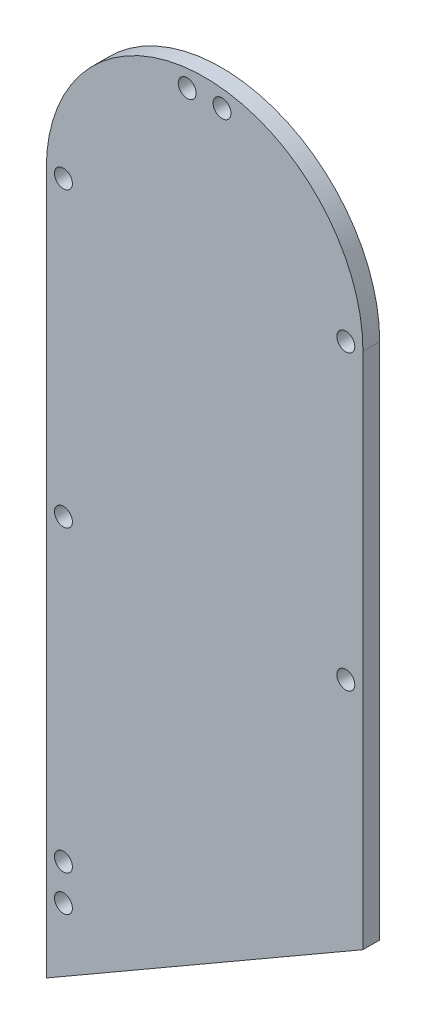
ISO-10303-21;
HEADER;
FILE_DESCRIPTION(('STEP AP214'),'2;1');
FILE_NAME('part.step','',(''),(''),'','','');
FILE_SCHEMA(('AUTOMOTIVE_DESIGN { 1 0 10303 214 1 1 1 1 }'));
ENDSEC;
DATA;
#1=APPLICATION_CONTEXT('core data for automotive mechanical design processes');
#2=APPLICATION_PROTOCOL_DEFINITION('international standard','automotive_design',2000,#1);
#3=PRODUCT_CONTEXT('',#1,'mechanical');
#4=PRODUCT('Part','Part','',(#3));
#5=PRODUCT_RELATED_PRODUCT_CATEGORY('part','',(#4));
#6=PRODUCT_DEFINITION_FORMATION('','',#4);
#7=PRODUCT_DEFINITION_CONTEXT('part definition',#1,'design');
#8=PRODUCT_DEFINITION('design','',#6,#7);
#9=PRODUCT_DEFINITION_SHAPE('','',#8);
#10=(LENGTH_UNIT() NAMED_UNIT(*) SI_UNIT(.MILLI.,.METRE.));
#11=(NAMED_UNIT(*) PLANE_ANGLE_UNIT() SI_UNIT($,.RADIAN.));
#12=(NAMED_UNIT(*) SI_UNIT($,.STERADIAN.) SOLID_ANGLE_UNIT());
#13=UNCERTAINTY_MEASURE_WITH_UNIT(LENGTH_MEASURE(1.E-05),#10,'distance_accuracy_value','');
#14=(GEOMETRIC_REPRESENTATION_CONTEXT(3) GLOBAL_UNCERTAINTY_ASSIGNED_CONTEXT((#13)) GLOBAL_UNIT_ASSIGNED_CONTEXT((#10,
#11,#12)) REPRESENTATION_CONTEXT('',''));
#15=CARTESIAN_POINT('',(0.,0.,0.));
#16=DIRECTION('',(0.,0.,1.));
#17=DIRECTION('',(1.,0.,0.));
#18=AXIS2_PLACEMENT_3D('',#15,#16,#17);
#19=CARTESIAN_POINT('',(24.5827179372451,-59.5829059297929,3.175));
#20=DIRECTION('',(0.,0.,1.));
#21=DIRECTION('',(1.,0.,0.));
#22=AXIS2_PLACEMENT_3D('',#19,#20,#21);
#23=PLANE('',#22);
#24=DIRECTION('',(-0.866025403784438,-0.500000000000001,0.));
#25=VECTOR('',#24,1.);
#26=CARTESIAN_POINT('',(-23.1785985762499,28.3308495887852,3.175));
#27=LINE('',#26,#25);
#28=CARTESIAN_POINT('',(54.5827179372451,73.2263666103914,3.175));
#29=VERTEX_POINT('',#28);
#30=CARTESIAN_POINT('',(-5.41728206275491,38.5853504590137,3.175));
#31=VERTEX_POINT('',#30);
#32=EDGE_CURVE('E48',#29,#31,#27,.T.);
#33=ORIENTED_EDGE('',*,*,#32,.F.);
#34=DIRECTION('',(0.,1.,0.));
#35=VECTOR('',#34,1.);
#36=CARTESIAN_POINT('',(54.5827179372451,-59.5829059297929,3.175));
#37=LINE('',#36,#35);
#38=CARTESIAN_POINT('',(54.5827179372451,171.394622999198,3.175));
#39=VERTEX_POINT('',#38);
#40=EDGE_CURVE('E91',#29,#39,#37,.T.);
#41=ORIENTED_EDGE('',*,*,#40,.T.);
#42=CARTESIAN_POINT('',(24.5827179372451,171.394622999198,3.175));
#43=DIRECTION('',(0.,0.,1.));
#44=DIRECTION('',(1.,0.,0.));
#45=AXIS2_PLACEMENT_3D('',#42,#43,#44);
#46=CIRCLE('',#45,30.);
#47=CARTESIAN_POINT('',(-5.41728206275491,171.394622999198,3.175));
#48=VERTEX_POINT('',#47);
#49=EDGE_CURVE('E56',#39,#48,#46,.T.);
#50=ORIENTED_EDGE('',*,*,#49,.T.);
#51=DIRECTION('',(0.,-1.,0.));
#52=VECTOR('',#51,1.);
#53=CARTESIAN_POINT('',(-5.41728206275491,171.394622999198,3.175));
#54=LINE('',#53,#52);
#55=EDGE_CURVE('E84',#48,#31,#54,.T.);
#56=ORIENTED_EDGE('',*,*,#55,.T.);
#57=EDGE_LOOP('',(#33,#41,#50,#56));
#58=FACE_BOUND('',#57,.T.);
#59=CARTESIAN_POINT('',(21.2827179372451,197.940291195723,3.175));
#60=DIRECTION('',(0.,0.,1.));
#61=DIRECTION('',(1.,0.,0.));
#62=AXIS2_PLACEMENT_3D('',#59,#60,#61);
#63=CIRCLE('',#62,1.70000000000001);
#64=CARTESIAN_POINT('',(22.9827179372451,197.940291195723,3.175));
#65=VERTEX_POINT('',#64);
#66=EDGE_CURVE('E132',#65,#65,#63,.T.);
#67=ORIENTED_EDGE('',*,*,#66,.F.);
#68=EDGE_LOOP('',(#67));
#69=FACE_BOUND('',#68,.T.);
#70=CARTESIAN_POINT('',(51.3327179372449,115.905858534703,3.175));
#71=DIRECTION('',(0.,0.,1.));
#72=DIRECTION('',(1.,0.,0.));
#73=AXIS2_PLACEMENT_3D('',#70,#71,#72);
#74=CIRCLE('',#73,1.70000000000001);
#75=CARTESIAN_POINT('',(53.0327179372449,115.905858534703,3.175));
#76=VERTEX_POINT('',#75);
#77=EDGE_CURVE('E120',#76,#76,#74,.T.);
#78=ORIENTED_EDGE('',*,*,#77,.F.);
#79=EDGE_LOOP('',(#78));
#80=FACE_BOUND('',#79,.T.);
#81=CARTESIAN_POINT('',(51.3327179372474,171.3946229992,3.175));
#82=DIRECTION('',(0.,0.,1.));
#83=DIRECTION('',(1.,0.,0.));
#84=AXIS2_PLACEMENT_3D('',#81,#82,#83);
#85=CIRCLE('',#84,1.70000000000001);
#86=CARTESIAN_POINT('',(53.0327179372474,171.3946229992,3.175));
#87=VERTEX_POINT('',#86);
#88=EDGE_CURVE('E102',#87,#87,#85,.T.);
#89=ORIENTED_EDGE('',*,*,#88,.F.);
#90=EDGE_LOOP('',(#89));
#91=FACE_BOUND('',#90,.T.);
#92=CARTESIAN_POINT('',(27.8827179372451,197.940291195723,3.175));
#93=DIRECTION('',(0.,0.,1.));
#94=DIRECTION('',(1.,0.,0.));
#95=AXIS2_PLACEMENT_3D('',#92,#93,#94);
#96=CIRCLE('',#95,1.70000000000001);
#97=CARTESIAN_POINT('',(29.5827179372451,197.940291195723,3.175));
#98=VERTEX_POINT('',#97);
#99=EDGE_CURVE('E96',#98,#98,#96,.T.);
#100=ORIENTED_EDGE('',*,*,#99,.F.);
#101=EDGE_LOOP('',(#100));
#102=FACE_BOUND('',#101,.T.);
#103=CARTESIAN_POINT('',(-2.1672820627549,59.3058585347025,3.175));
#104=DIRECTION('',(0.,0.,1.));
#105=DIRECTION('',(1.,0.,0.));
#106=AXIS2_PLACEMENT_3D('',#103,#104,#105);
#107=CIRCLE('',#106,1.70000000000001);
#108=CARTESIAN_POINT('',(-0.46728206275489,59.3058585347025,3.175));
#109=VERTEX_POINT('',#108);
#110=EDGE_CURVE('E108',#109,#109,#107,.T.);
#111=ORIENTED_EDGE('',*,*,#110,.F.);
#112=EDGE_LOOP('',(#111));
#113=FACE_BOUND('',#112,.T.);
#114=CARTESIAN_POINT('',(-2.16728206275266,171.394622999196,3.175));
#115=DIRECTION('',(0.,0.,1.));
#116=DIRECTION('',(1.,0.,0.));
#117=AXIS2_PLACEMENT_3D('',#114,#115,#116);
#118=CIRCLE('',#117,1.70000000000001);
#119=CARTESIAN_POINT('',(-0.467282062752642,171.394622999196,3.175));
#120=VERTEX_POINT('',#119);
#121=EDGE_CURVE('E114',#120,#120,#118,.T.);
#122=ORIENTED_EDGE('',*,*,#121,.F.);
#123=EDGE_LOOP('',(#122));
#124=FACE_BOUND('',#123,.T.);
#125=CARTESIAN_POINT('',(-2.16728206275513,115.905858534703,3.175));
#126=DIRECTION('',(0.,0.,1.));
#127=DIRECTION('',(1.,0.,0.));
#128=AXIS2_PLACEMENT_3D('',#125,#126,#127);
#129=CIRCLE('',#128,1.70000000000001);
#130=CARTESIAN_POINT('',(-0.467282062755112,115.905858534703,3.175));
#131=VERTEX_POINT('',#130);
#132=EDGE_CURVE('E126',#131,#131,#129,.T.);
#133=ORIENTED_EDGE('',*,*,#132,.F.);
#134=EDGE_LOOP('',(#133));
#135=FACE_BOUND('',#134,.T.);
#136=CARTESIAN_POINT('',(-2.1672820627549,52.5058585347025,3.175));
#137=DIRECTION('',(0.,0.,1.));
#138=DIRECTION('',(1.,0.,0.));
#139=AXIS2_PLACEMENT_3D('',#136,#137,#138);
#140=CIRCLE('',#139,1.70000000000001);
#141=CARTESIAN_POINT('',(-0.46728206275489,52.5058585347025,3.175));
#142=VERTEX_POINT('',#141);
#143=EDGE_CURVE('E138',#142,#142,#140,.T.);
#144=ORIENTED_EDGE('',*,*,#143,.F.);
#145=EDGE_LOOP('',(#144));
#146=FACE_BOUND('',#145,.T.);
#147=ADVANCED_FACE('F33',(#58,#69,#80,#91,#102,#113,#124,#135,#146),#23,.T.);
#148=CARTESIAN_POINT('',(24.5827179372451,-59.5829059297929,0.));
#149=DIRECTION('',(0.,0.,1.));
#150=DIRECTION('',(1.,0.,0.));
#151=AXIS2_PLACEMENT_3D('',#148,#149,#150);
#152=PLANE('',#151);
#153=DIRECTION('',(0.,1.,0.));
#154=VECTOR('',#153,1.);
#155=CARTESIAN_POINT('',(54.5827179372451,-59.5829059297929,0.));
#156=LINE('',#155,#154);
#157=CARTESIAN_POINT('',(54.5827179372451,73.2263666103914,0.));
#158=VERTEX_POINT('',#157);
#159=CARTESIAN_POINT('',(54.5827179372451,171.394622999198,0.));
#160=VERTEX_POINT('',#159);
#161=EDGE_CURVE('E79',#158,#160,#156,.T.);
#162=ORIENTED_EDGE('',*,*,#161,.F.);
#163=DIRECTION('',(-0.866025403784438,-0.500000000000001,0.));
#164=VECTOR('',#163,1.);
#165=CARTESIAN_POINT('',(-23.1785985762499,28.3308495887852,0.));
#166=LINE('',#165,#164);
#167=CARTESIAN_POINT('',(-5.41728206275491,38.5853504590137,0.));
#168=VERTEX_POINT('',#167);
#169=EDGE_CURVE('E90',#158,#168,#166,.T.);
#170=ORIENTED_EDGE('',*,*,#169,.T.);
#171=DIRECTION('',(0.,-1.,0.));
#172=VECTOR('',#171,1.);
#173=CARTESIAN_POINT('',(-5.41728206275491,171.394622999198,0.));
#174=LINE('',#173,#172);
#175=CARTESIAN_POINT('',(-5.41728206275491,171.394622999198,0.));
#176=VERTEX_POINT('',#175);
#177=EDGE_CURVE('E78',#176,#168,#174,.T.);
#178=ORIENTED_EDGE('',*,*,#177,.F.);
#179=CARTESIAN_POINT('',(24.5827179372451,171.394622999198,0.));
#180=DIRECTION('',(0.,0.,1.));
#181=DIRECTION('',(1.,0.,0.));
#182=AXIS2_PLACEMENT_3D('',#179,#180,#181);
#183=CIRCLE('',#182,30.);
#184=EDGE_CURVE('E69',#160,#176,#183,.T.);
#185=ORIENTED_EDGE('',*,*,#184,.F.);
#186=EDGE_LOOP('',(#162,#170,#178,#185));
#187=FACE_BOUND('',#186,.T.);
#188=CARTESIAN_POINT('',(27.8827179372451,197.940291195723,0.));
#189=DIRECTION('',(0.,0.,1.));
#190=DIRECTION('',(1.,0.,0.));
#191=AXIS2_PLACEMENT_3D('',#188,#189,#190);
#192=CIRCLE('',#191,1.70000000000001);
#193=CARTESIAN_POINT('',(29.5827179372451,197.940291195723,0.));
#194=VERTEX_POINT('',#193);
#195=EDGE_CURVE('E99',#194,#194,#192,.T.);
#196=ORIENTED_EDGE('',*,*,#195,.T.);
#197=EDGE_LOOP('',(#196));
#198=FACE_BOUND('',#197,.T.);
#199=CARTESIAN_POINT('',(51.3327179372474,171.3946229992,0.));
#200=DIRECTION('',(0.,0.,1.));
#201=DIRECTION('',(1.,0.,0.));
#202=AXIS2_PLACEMENT_3D('',#199,#200,#201);
#203=CIRCLE('',#202,1.70000000000001);
#204=CARTESIAN_POINT('',(53.0327179372474,171.3946229992,0.));
#205=VERTEX_POINT('',#204);
#206=EDGE_CURVE('E105',#205,#205,#203,.T.);
#207=ORIENTED_EDGE('',*,*,#206,.T.);
#208=EDGE_LOOP('',(#207));
#209=FACE_BOUND('',#208,.T.);
#210=CARTESIAN_POINT('',(-2.1672820627549,59.3058585347025,0.));
#211=DIRECTION('',(0.,0.,1.));
#212=DIRECTION('',(1.,0.,0.));
#213=AXIS2_PLACEMENT_3D('',#210,#211,#212);
#214=CIRCLE('',#213,1.70000000000001);
#215=CARTESIAN_POINT('',(-0.46728206275489,59.3058585347025,0.));
#216=VERTEX_POINT('',#215);
#217=EDGE_CURVE('E111',#216,#216,#214,.T.);
#218=ORIENTED_EDGE('',*,*,#217,.T.);
#219=EDGE_LOOP('',(#218));
#220=FACE_BOUND('',#219,.T.);
#221=CARTESIAN_POINT('',(-2.16728206275266,171.394622999196,0.));
#222=DIRECTION('',(0.,0.,1.));
#223=DIRECTION('',(1.,0.,0.));
#224=AXIS2_PLACEMENT_3D('',#221,#222,#223);
#225=CIRCLE('',#224,1.70000000000001);
#226=CARTESIAN_POINT('',(-0.467282062752642,171.394622999196,0.));
#227=VERTEX_POINT('',#226);
#228=EDGE_CURVE('E117',#227,#227,#225,.T.);
#229=ORIENTED_EDGE('',*,*,#228,.T.);
#230=EDGE_LOOP('',(#229));
#231=FACE_BOUND('',#230,.T.);
#232=CARTESIAN_POINT('',(51.3327179372449,115.905858534703,0.));
#233=DIRECTION('',(0.,0.,1.));
#234=DIRECTION('',(1.,0.,0.));
#235=AXIS2_PLACEMENT_3D('',#232,#233,#234);
#236=CIRCLE('',#235,1.70000000000001);
#237=CARTESIAN_POINT('',(53.0327179372449,115.905858534703,0.));
#238=VERTEX_POINT('',#237);
#239=EDGE_CURVE('E123',#238,#238,#236,.T.);
#240=ORIENTED_EDGE('',*,*,#239,.T.);
#241=EDGE_LOOP('',(#240));
#242=FACE_BOUND('',#241,.T.);
#243=CARTESIAN_POINT('',(-2.16728206275513,115.905858534703,0.));
#244=DIRECTION('',(0.,0.,1.));
#245=DIRECTION('',(1.,0.,0.));
#246=AXIS2_PLACEMENT_3D('',#243,#244,#245);
#247=CIRCLE('',#246,1.70000000000001);
#248=CARTESIAN_POINT('',(-0.467282062755112,115.905858534703,0.));
#249=VERTEX_POINT('',#248);
#250=EDGE_CURVE('E129',#249,#249,#247,.T.);
#251=ORIENTED_EDGE('',*,*,#250,.T.);
#252=EDGE_LOOP('',(#251));
#253=FACE_BOUND('',#252,.T.);
#254=CARTESIAN_POINT('',(21.2827179372451,197.940291195723,0.));
#255=DIRECTION('',(0.,0.,1.));
#256=DIRECTION('',(1.,0.,0.));
#257=AXIS2_PLACEMENT_3D('',#254,#255,#256);
#258=CIRCLE('',#257,1.70000000000001);
#259=CARTESIAN_POINT('',(22.9827179372451,197.940291195723,0.));
#260=VERTEX_POINT('',#259);
#261=EDGE_CURVE('E135',#260,#260,#258,.T.);
#262=ORIENTED_EDGE('',*,*,#261,.T.);
#263=EDGE_LOOP('',(#262));
#264=FACE_BOUND('',#263,.T.);
#265=CARTESIAN_POINT('',(-2.1672820627549,52.5058585347025,0.));
#266=DIRECTION('',(0.,0.,1.));
#267=DIRECTION('',(1.,0.,0.));
#268=AXIS2_PLACEMENT_3D('',#265,#266,#267);
#269=CIRCLE('',#268,1.70000000000001);
#270=CARTESIAN_POINT('',(-0.46728206275489,52.5058585347025,0.));
#271=VERTEX_POINT('',#270);
#272=EDGE_CURVE('E141',#271,#271,#269,.T.);
#273=ORIENTED_EDGE('',*,*,#272,.T.);
#274=EDGE_LOOP('',(#273));
#275=FACE_BOUND('',#274,.T.);
#276=ADVANCED_FACE('F87',(#187,#198,#209,#220,#231,#242,#253,#264,#275),#152,.F.);
#277=CARTESIAN_POINT('',(54.5827179372451,-59.5829059297929,3.175));
#278=DIRECTION('',(-1.,0.,0.));
#279=DIRECTION('',(0.,0.,1.));
#280=AXIS2_PLACEMENT_3D('',#277,#278,#279);
#281=PLANE('',#280);
#282=ORIENTED_EDGE('',*,*,#40,.F.);
#283=DIRECTION('',(0.,0.,-1.));
#284=VECTOR('',#283,1.);
#285=CARTESIAN_POINT('',(54.5827179372451,73.2263666103914,3.175));
#286=LINE('',#285,#284);
#287=EDGE_CURVE('E144',#29,#158,#286,.T.);
#288=ORIENTED_EDGE('',*,*,#287,.T.);
#289=ORIENTED_EDGE('',*,*,#161,.T.);
#290=DIRECTION('',(0.,0.,-1.));
#291=VECTOR('',#290,1.);
#292=CARTESIAN_POINT('',(54.5827179372451,171.394622999198,3.175));
#293=LINE('',#292,#291);
#294=EDGE_CURVE('E41',#39,#160,#293,.T.);
#295=ORIENTED_EDGE('',*,*,#294,.F.);
#296=EDGE_LOOP('',(#282,#288,#289,#295));
#297=FACE_BOUND('',#296,.T.);
#298=ADVANCED_FACE('F35',(#297),#281,.F.);
#299=CARTESIAN_POINT('',(24.5827179372451,171.394622999198,3.175));
#300=DIRECTION('',(0.,0.,-1.));
#301=DIRECTION('',(-1.,0.,0.));
#302=AXIS2_PLACEMENT_3D('',#299,#300,#301);
#303=CYLINDRICAL_SURFACE('',#302,30.);
#304=ORIENTED_EDGE('',*,*,#184,.T.);
#305=DIRECTION('',(0.,0.,-1.));
#306=VECTOR('',#305,1.);
#307=CARTESIAN_POINT('',(-5.41728206275491,171.394622999198,3.175));
#308=LINE('',#307,#306);
#309=EDGE_CURVE('E72',#48,#176,#308,.T.);
#310=ORIENTED_EDGE('',*,*,#309,.F.);
#311=ORIENTED_EDGE('',*,*,#49,.F.);
#312=ORIENTED_EDGE('',*,*,#294,.T.);
#313=EDGE_LOOP('',(#304,#310,#311,#312));
#314=FACE_BOUND('',#313,.T.);
#315=ADVANCED_FACE('F71',(#314),#303,.T.);
#316=CARTESIAN_POINT('',(-5.41728206275491,171.394622999198,3.175));
#317=DIRECTION('',(1.,0.,0.));
#318=DIRECTION('',(0.,0.,-1.));
#319=AXIS2_PLACEMENT_3D('',#316,#317,#318);
#320=PLANE('',#319);
#321=ORIENTED_EDGE('',*,*,#177,.T.);
#322=DIRECTION('',(0.,0.,1.));
#323=VECTOR('',#322,1.);
#324=CARTESIAN_POINT('',(-5.41728206275491,38.5853504590137,3.175));
#325=LINE('',#324,#323);
#326=EDGE_CURVE('E11',#168,#31,#325,.T.);
#327=ORIENTED_EDGE('',*,*,#326,.T.);
#328=ORIENTED_EDGE('',*,*,#55,.F.);
#329=ORIENTED_EDGE('',*,*,#309,.T.);
#330=EDGE_LOOP('',(#321,#327,#328,#329));
#331=FACE_BOUND('',#330,.T.);
#332=ADVANCED_FACE('F83',(#331),#320,.F.);
#333=CARTESIAN_POINT('',(27.8827179372451,197.940291195723,3.175));
#334=DIRECTION('',(0.,0.,-1.));
#335=DIRECTION('',(-1.,0.,0.));
#336=AXIS2_PLACEMENT_3D('',#333,#334,#335);
#337=CYLINDRICAL_SURFACE('',#336,1.70000000000001);
#338=ORIENTED_EDGE('',*,*,#99,.T.);
#339=EDGE_LOOP('',(#338));
#340=FACE_BOUND('',#339,.T.);
#341=ORIENTED_EDGE('',*,*,#195,.F.);
#342=EDGE_LOOP('',(#341));
#343=FACE_BOUND('',#342,.T.);
#344=ADVANCED_FACE('F191',(#340,#343),#337,.F.);
#345=CARTESIAN_POINT('',(51.3327179372474,171.3946229992,3.175));
#346=DIRECTION('',(0.,0.,-1.));
#347=DIRECTION('',(-1.,0.,0.));
#348=AXIS2_PLACEMENT_3D('',#345,#346,#347);
#349=CYLINDRICAL_SURFACE('',#348,1.70000000000001);
#350=ORIENTED_EDGE('',*,*,#88,.T.);
#351=EDGE_LOOP('',(#350));
#352=FACE_BOUND('',#351,.T.);
#353=ORIENTED_EDGE('',*,*,#206,.F.);
#354=EDGE_LOOP('',(#353));
#355=FACE_BOUND('',#354,.T.);
#356=ADVANCED_FACE('F208',(#352,#355),#349,.F.);
#357=CARTESIAN_POINT('',(-2.1672820627549,59.3058585347025,3.175));
#358=DIRECTION('',(0.,0.,-1.));
#359=DIRECTION('',(-1.,0.,0.));
#360=AXIS2_PLACEMENT_3D('',#357,#358,#359);
#361=CYLINDRICAL_SURFACE('',#360,1.70000000000001);
#362=ORIENTED_EDGE('',*,*,#110,.T.);
#363=EDGE_LOOP('',(#362));
#364=FACE_BOUND('',#363,.T.);
#365=ORIENTED_EDGE('',*,*,#217,.F.);
#366=EDGE_LOOP('',(#365));
#367=FACE_BOUND('',#366,.T.);
#368=ADVANCED_FACE('F215',(#364,#367),#361,.F.);
#369=CARTESIAN_POINT('',(-2.16728206275266,171.394622999196,3.175));
#370=DIRECTION('',(0.,0.,-1.));
#371=DIRECTION('',(-1.,0.,0.));
#372=AXIS2_PLACEMENT_3D('',#369,#370,#371);
#373=CYLINDRICAL_SURFACE('',#372,1.70000000000001);
#374=ORIENTED_EDGE('',*,*,#121,.T.);
#375=EDGE_LOOP('',(#374));
#376=FACE_BOUND('',#375,.T.);
#377=ORIENTED_EDGE('',*,*,#228,.F.);
#378=EDGE_LOOP('',(#377));
#379=FACE_BOUND('',#378,.T.);
#380=ADVANCED_FACE('F223',(#376,#379),#373,.F.);
#381=CARTESIAN_POINT('',(51.3327179372449,115.905858534703,3.175));
#382=DIRECTION('',(0.,0.,-1.));
#383=DIRECTION('',(-1.,0.,0.));
#384=AXIS2_PLACEMENT_3D('',#381,#382,#383);
#385=CYLINDRICAL_SURFACE('',#384,1.70000000000001);
#386=ORIENTED_EDGE('',*,*,#77,.T.);
#387=EDGE_LOOP('',(#386));
#388=FACE_BOUND('',#387,.T.);
#389=ORIENTED_EDGE('',*,*,#239,.F.);
#390=EDGE_LOOP('',(#389));
#391=FACE_BOUND('',#390,.T.);
#392=ADVANCED_FACE('F231',(#388,#391),#385,.F.);
#393=CARTESIAN_POINT('',(-2.16728206275513,115.905858534703,3.175));
#394=DIRECTION('',(0.,0.,-1.));
#395=DIRECTION('',(-1.,0.,0.));
#396=AXIS2_PLACEMENT_3D('',#393,#394,#395);
#397=CYLINDRICAL_SURFACE('',#396,1.70000000000001);
#398=ORIENTED_EDGE('',*,*,#132,.T.);
#399=EDGE_LOOP('',(#398));
#400=FACE_BOUND('',#399,.T.);
#401=ORIENTED_EDGE('',*,*,#250,.F.);
#402=EDGE_LOOP('',(#401));
#403=FACE_BOUND('',#402,.T.);
#404=ADVANCED_FACE('F239',(#400,#403),#397,.F.);
#405=CARTESIAN_POINT('',(21.2827179372451,197.940291195723,3.175));
#406=DIRECTION('',(0.,0.,-1.));
#407=DIRECTION('',(-1.,0.,0.));
#408=AXIS2_PLACEMENT_3D('',#405,#406,#407);
#409=CYLINDRICAL_SURFACE('',#408,1.70000000000001);
#410=ORIENTED_EDGE('',*,*,#66,.T.);
#411=EDGE_LOOP('',(#410));
#412=FACE_BOUND('',#411,.T.);
#413=ORIENTED_EDGE('',*,*,#261,.F.);
#414=EDGE_LOOP('',(#413));
#415=FACE_BOUND('',#414,.T.);
#416=ADVANCED_FACE('F179',(#412,#415),#409,.F.);
#417=CARTESIAN_POINT('',(-2.1672820627549,52.5058585347025,3.175));
#418=DIRECTION('',(0.,0.,-1.));
#419=DIRECTION('',(-1.,0.,0.));
#420=AXIS2_PLACEMENT_3D('',#417,#418,#419);
#421=CYLINDRICAL_SURFACE('',#420,1.70000000000001);
#422=ORIENTED_EDGE('',*,*,#143,.T.);
#423=EDGE_LOOP('',(#422));
#424=FACE_BOUND('',#423,.T.);
#425=ORIENTED_EDGE('',*,*,#272,.F.);
#426=EDGE_LOOP('',(#425));
#427=FACE_BOUND('',#426,.T.);
#428=ADVANCED_FACE('F176',(#424,#427),#421,.F.);
#429=CARTESIAN_POINT('',(-23.1785985762499,28.3308495887852,0.));
#430=DIRECTION('',(-0.500000000000001,0.866025403784438,0.));
#431=DIRECTION('',(-0.866025403784438,-0.500000000000002,0.));
#432=AXIS2_PLACEMENT_3D('',#429,#430,#431);
#433=PLANE('',#432);
#434=ORIENTED_EDGE('',*,*,#32,.T.);
#435=ORIENTED_EDGE('',*,*,#326,.F.);
#436=ORIENTED_EDGE('',*,*,#169,.F.);
#437=ORIENTED_EDGE('',*,*,#287,.F.);
#438=EDGE_LOOP('',(#434,#435,#436,#437));
#439=FACE_BOUND('',#438,.T.);
#440=ADVANCED_FACE('F155',(#439),#433,.F.);
#441=CLOSED_SHELL('',(#147,#276,#298,#315,#332,#344,#356,#368,#380,#392,#404,#416,#428,#440));
#442=MANIFOLD_SOLID_BREP('B2',#441);
#443=ADVANCED_BREP_SHAPE_REPRESENTATION('',(#18,#442),#14);
#444=SHAPE_DEFINITION_REPRESENTATION(#9,#443);
ENDSEC;
END-ISO-10303-21;
